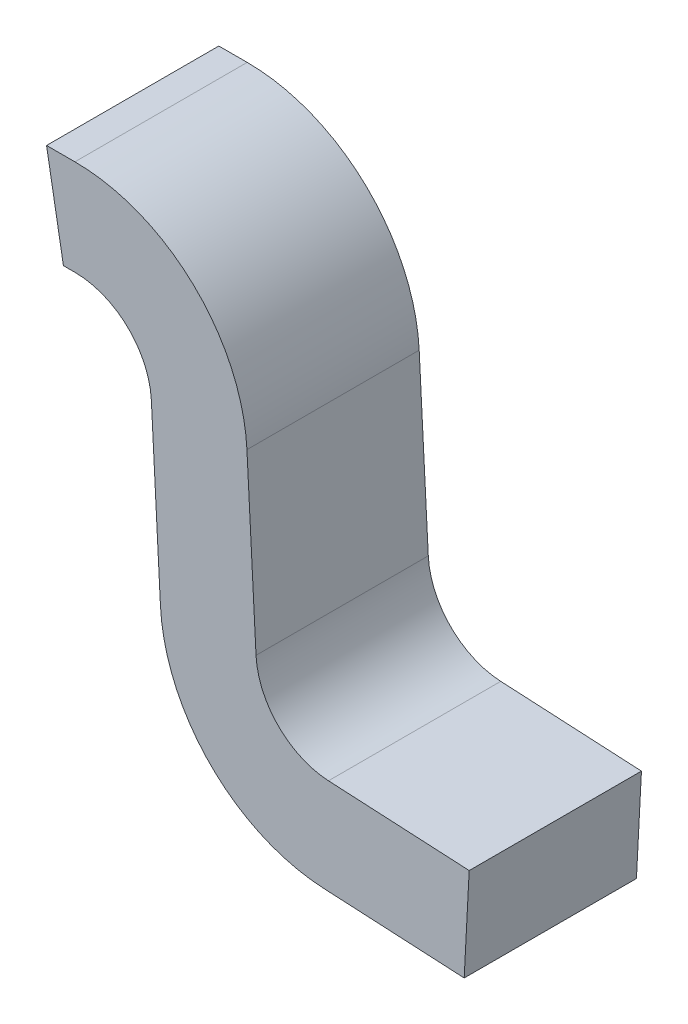
ISO-10303-21;
HEADER;
FILE_DESCRIPTION(('STEP AP214'),'2;1');
FILE_NAME('part.step','',(''),(''),'','','');
FILE_SCHEMA(('AUTOMOTIVE_DESIGN { 1 0 10303 214 1 1 1 1 }'));
ENDSEC;
DATA;
#1=APPLICATION_CONTEXT('core data for automotive mechanical design processes');
#2=APPLICATION_PROTOCOL_DEFINITION('international standard','automotive_design',2000,#1);
#3=PRODUCT_CONTEXT('',#1,'mechanical');
#4=PRODUCT('Part','Part','',(#3));
#5=PRODUCT_RELATED_PRODUCT_CATEGORY('part','',(#4));
#6=PRODUCT_DEFINITION_FORMATION('','',#4);
#7=PRODUCT_DEFINITION_CONTEXT('part definition',#1,'design');
#8=PRODUCT_DEFINITION('design','',#6,#7);
#9=PRODUCT_DEFINITION_SHAPE('','',#8);
#10=(LENGTH_UNIT() NAMED_UNIT(*) SI_UNIT(.MILLI.,.METRE.));
#11=(NAMED_UNIT(*) PLANE_ANGLE_UNIT() SI_UNIT($,.RADIAN.));
#12=(NAMED_UNIT(*) SI_UNIT($,.STERADIAN.) SOLID_ANGLE_UNIT());
#13=UNCERTAINTY_MEASURE_WITH_UNIT(LENGTH_MEASURE(1.E-05),#10,'distance_accuracy_value','');
#14=(GEOMETRIC_REPRESENTATION_CONTEXT(3) GLOBAL_UNCERTAINTY_ASSIGNED_CONTEXT((#13)) GLOBAL_UNIT_ASSIGNED_CONTEXT((#10,
#11,#12)) REPRESENTATION_CONTEXT('',''));
#15=CARTESIAN_POINT('',(0.,0.,0.));
#16=DIRECTION('',(0.,0.,1.));
#17=DIRECTION('',(1.,0.,0.));
#18=AXIS2_PLACEMENT_3D('',#15,#16,#17);
#19=CARTESIAN_POINT('',(0.,0.,-0.7625));
#20=DIRECTION('',(0.,0.,1.));
#21=DIRECTION('',(1.,0.,0.));
#22=AXIS2_PLACEMENT_3D('',#19,#20,#21);
#23=PLANE('',#22);
#24=DIRECTION('',(-0.0523359562429177,0.998629534754575,0.));
#25=VECTOR('',#24,1.);
#26=CARTESIAN_POINT('',(0.861573213012,-0.31493822705,-0.7625));
#27=LINE('',#26,#25);
#28=CARTESIAN_POINT('',(0.861573213012008,-0.31493822705016,-0.7625));
#29=VERTEX_POINT('',#28);
#30=CARTESIAN_POINT('',(0.849691645319655,-0.0882244098453541,-0.7625));
#31=VERTEX_POINT('',#30);
#32=EDGE_CURVE('E144',#29,#31,#27,.T.);
#33=ORIENTED_EDGE('',*,*,#32,.F.);
#34=CARTESIAN_POINT('',(0.961436166488,-0.309704631426,-0.7625));
#35=DIRECTION('',(0.,0.,1.));
#36=DIRECTION('',(1.,0.,0.));
#37=AXIS2_PLACEMENT_3D('',#34,#35,#36);
#38=CIRCLE('',#37,0.1);
#39=CARTESIAN_POINT('',(0.956202570863354,-0.40956758490123,-0.7625));
#40=VERTEX_POINT('',#39);
#41=EDGE_CURVE('E151',#29,#40,#38,.T.);
#42=ORIENTED_EDGE('',*,*,#41,.T.);
#43=DIRECTION('',(-0.998629534754575,0.0523359562429177,0.));
#44=VECTOR('',#43,1.);
#45=CARTESIAN_POINT('',(1.14,-0.4192,-0.7625));
#46=LINE('',#45,#44);
#47=CARTESIAN_POINT('',(1.14000000000012,-0.419200000000006,-0.7625));
#48=VERTEX_POINT('',#47);
#49=EDGE_CURVE('E148',#48,#40,#46,.T.);
#50=ORIENTED_EDGE('',*,*,#49,.F.);
#51=DIRECTION('',(0.0523359562429177,0.998629534754575,0.));
#52=VECTOR('',#51,1.);
#53=CARTESIAN_POINT('',(1.13345800547,-0.544028691844,-0.7625));
#54=LINE('',#53,#52);
#55=CARTESIAN_POINT('',(1.13345800547,-0.544028691843999,-0.7625));
#56=VERTEX_POINT('',#55);
#57=EDGE_CURVE('E155',#56,#48,#54,.T.);
#58=ORIENTED_EDGE('',*,*,#57,.F.);
#59=DIRECTION('',(0.998629534754575,-0.0523359562429177,0.));
#60=VECTOR('',#59,1.);
#61=CARTESIAN_POINT('',(0.949660576333,-0.534396276745,-0.7625));
#62=LINE('',#61,#60);
#63=CARTESIAN_POINT('',(0.949660576333192,-0.53439627674501,-0.7625));
#64=VERTEX_POINT('',#63);
#65=EDGE_CURVE('E160',#64,#56,#62,.T.);
#66=ORIENTED_EDGE('',*,*,#65,.F.);
#67=CARTESIAN_POINT('',(0.961436166488,-0.309704631426,-0.7625));
#68=DIRECTION('',(0.,0.,1.));
#69=DIRECTION('',(1.,0.,0.));
#70=AXIS2_PLACEMENT_3D('',#67,#68,#69);
#71=CIRCLE('',#70,0.225);
#72=CARTESIAN_POINT('',(0.736744521168336,-0.321480221580316,-0.7625));
#73=VERTEX_POINT('',#72);
#74=EDGE_CURVE('E117',#73,#64,#71,.T.);
#75=ORIENTED_EDGE('',*,*,#74,.F.);
#76=DIRECTION('',(0.0523359562429177,-0.998629534754575,0.));
#77=VECTOR('',#76,1.);
#78=CARTESIAN_POINT('',(0.724862953476,-0.09476640437571,-0.7625));
#79=LINE('',#78,#77);
#80=CARTESIAN_POINT('',(0.724862953475999,-0.0947664043756949,-0.7625));
#81=VERTEX_POINT('',#80);
#82=EDGE_CURVE('E114',#81,#73,#79,.T.);
#83=ORIENTED_EDGE('',*,*,#82,.F.);
#84=CARTESIAN_POINT('',(0.625,-0.1,-0.7625));
#85=DIRECTION('',(0.,0.,1.));
#86=DIRECTION('',(1.,0.,0.));
#87=AXIS2_PLACEMENT_3D('',#84,#85,#86);
#88=CIRCLE('',#87,0.1);
#89=CARTESIAN_POINT('',(0.625,0.,-0.7625));
#90=VERTEX_POINT('',#89);
#91=EDGE_CURVE('E20',#81,#90,#88,.T.);
#92=ORIENTED_EDGE('',*,*,#91,.T.);
#93=DIRECTION('',(1.,0.,0.));
#94=VECTOR('',#93,1.);
#95=CARTESIAN_POINT('',(0.61,0.,-0.7625));
#96=LINE('',#95,#94);
#97=CARTESIAN_POINT('',(0.609999999999862,0.,-0.7625));
#98=VERTEX_POINT('',#97);
#99=EDGE_CURVE('E132',#98,#90,#96,.T.);
#100=ORIENTED_EDGE('',*,*,#99,.F.);
#101=DIRECTION('',(0.173648177667033,-0.98480775301219,0.));
#102=VECTOR('',#101,1.);
#103=CARTESIAN_POINT('',(0.587959127411,0.125,-0.7625));
#104=LINE('',#103,#102);
#105=CARTESIAN_POINT('',(0.587959127411,0.125,-0.7625));
#106=VERTEX_POINT('',#105);
#107=EDGE_CURVE('E130',#106,#98,#104,.T.);
#108=ORIENTED_EDGE('',*,*,#107,.F.);
#109=DIRECTION('',(1.,0.,0.));
#110=VECTOR('',#109,1.);
#111=CARTESIAN_POINT('',(0.625,0.125,-0.7625));
#112=LINE('',#111,#110);
#113=CARTESIAN_POINT('',(0.625,0.125,-0.7625));
#114=VERTEX_POINT('',#113);
#115=EDGE_CURVE('E139',#114,#106,#112,.F.);
#116=ORIENTED_EDGE('',*,*,#115,.F.);
#117=CARTESIAN_POINT('',(0.625,-0.1,-0.7625));
#118=DIRECTION('',(0.,0.,1.));
#119=DIRECTION('',(1.,0.,0.));
#120=AXIS2_PLACEMENT_3D('',#117,#118,#119);
#121=CIRCLE('',#120,0.225);
#122=EDGE_CURVE('E180',#31,#114,#121,.T.);
#123=ORIENTED_EDGE('',*,*,#122,.F.);
#124=EDGE_LOOP('',(#33,#42,#50,#58,#66,#75,#83,#92,#100,#108,#116,#123));
#125=FACE_BOUND('',#124,.T.);
#126=ADVANCED_FACE('F17',(#125),#23,.F.);
#127=CARTESIAN_POINT('',(0.625,-0.1,-0.7625));
#128=DIRECTION('',(0.,0.,1.));
#129=DIRECTION('',(1.,0.,0.));
#130=AXIS2_PLACEMENT_3D('',#127,#128,#129);
#131=CYLINDRICAL_SURFACE('',#130,0.1);
#132=CARTESIAN_POINT('',(0.625,-0.1,-0.5375));
#133=DIRECTION('',(0.,0.,1.));
#134=DIRECTION('',(1.,0.,0.));
#135=AXIS2_PLACEMENT_3D('',#132,#133,#134);
#136=CIRCLE('',#135,0.1);
#137=CARTESIAN_POINT('',(0.625,0.,-0.5375));
#138=VERTEX_POINT('',#137);
#139=CARTESIAN_POINT('',(0.724862953476004,-0.0947664043757943,-0.5375));
#140=VERTEX_POINT('',#139);
#141=EDGE_CURVE('E178',#138,#140,#136,.F.);
#142=ORIENTED_EDGE('',*,*,#141,.F.);
#143=DIRECTION('',(0.,0.,-1.));
#144=VECTOR('',#143,1.);
#145=CARTESIAN_POINT('',(0.625,0.,-0.7625));
#146=LINE('',#145,#144);
#147=EDGE_CURVE('E110',#90,#138,#146,.F.);
#148=ORIENTED_EDGE('',*,*,#147,.F.);
#149=ORIENTED_EDGE('',*,*,#91,.F.);
#150=DIRECTION('',(0.,0.,1.));
#151=VECTOR('',#150,1.);
#152=CARTESIAN_POINT('',(0.724862953476,-0.09476640437571,-0.7625));
#153=LINE('',#152,#151);
#154=EDGE_CURVE('E107',#140,#81,#153,.F.);
#155=ORIENTED_EDGE('',*,*,#154,.F.);
#156=EDGE_LOOP('',(#142,#148,#149,#155));
#157=FACE_BOUND('',#156,.T.);
#158=ADVANCED_FACE('F105',(#157),#131,.F.);
#159=CARTESIAN_POINT('',(0.724862953476,-0.09476640437571,-0.7625));
#160=DIRECTION('',(-0.998629534754575,-0.0523359562429177,0.));
#161=DIRECTION('',(0.0523359562429177,-0.998629534754575,0.));
#162=AXIS2_PLACEMENT_3D('',#159,#160,#161);
#163=PLANE('',#162);
#164=ORIENTED_EDGE('',*,*,#154,.T.);
#165=ORIENTED_EDGE('',*,*,#82,.T.);
#166=DIRECTION('',(0.,0.,1.));
#167=VECTOR('',#166,1.);
#168=CARTESIAN_POINT('',(0.736744521168186,-0.32148022157999,-0.7625));
#169=LINE('',#168,#167);
#170=CARTESIAN_POINT('',(0.736744521168099,-0.321480221580105,-0.5375));
#171=VERTEX_POINT('',#170);
#172=EDGE_CURVE('E120',#171,#73,#169,.F.);
#173=ORIENTED_EDGE('',*,*,#172,.F.);
#174=DIRECTION('',(0.0523359562409312,-0.998629534754679,0.));
#175=VECTOR('',#174,1.);
#176=CARTESIAN_POINT('',(0.724862953476,-0.09476640437571,-0.5375));
#177=LINE('',#176,#175);
#178=EDGE_CURVE('E124',#140,#171,#177,.T.);
#179=ORIENTED_EDGE('',*,*,#178,.F.);
#180=EDGE_LOOP('',(#164,#165,#173,#179));
#181=FACE_BOUND('',#180,.T.);
#182=ADVANCED_FACE('F122',(#181),#163,.T.);
#183=CARTESIAN_POINT('',(0.961436166488,-0.309704631426,-0.7625));
#184=DIRECTION('',(0.,0.,1.));
#185=DIRECTION('',(1.,0.,0.));
#186=AXIS2_PLACEMENT_3D('',#183,#184,#185);
#187=CYLINDRICAL_SURFACE('',#186,0.225);
#188=ORIENTED_EDGE('',*,*,#172,.T.);
#189=ORIENTED_EDGE('',*,*,#74,.T.);
#190=DIRECTION('',(0.,0.,1.));
#191=VECTOR('',#190,1.);
#192=CARTESIAN_POINT('',(0.949660576333,-0.534396276745,-0.7625));
#193=LINE('',#192,#191);
#194=CARTESIAN_POINT('',(0.94966057633319,-0.53439627674501,-0.5375));
#195=VERTEX_POINT('',#194);
#196=EDGE_CURVE('E162',#195,#64,#193,.F.);
#197=ORIENTED_EDGE('',*,*,#196,.F.);
#198=CARTESIAN_POINT('',(0.961436166488,-0.309704631426,-0.5375));
#199=DIRECTION('',(0.,0.,1.));
#200=DIRECTION('',(1.,0.,0.));
#201=AXIS2_PLACEMENT_3D('',#198,#199,#200);
#202=CIRCLE('',#201,0.225);
#203=EDGE_CURVE('E174',#171,#195,#202,.T.);
#204=ORIENTED_EDGE('',*,*,#203,.F.);
#205=EDGE_LOOP('',(#188,#189,#197,#204));
#206=FACE_BOUND('',#205,.T.);
#207=ADVANCED_FACE('F186',(#206),#187,.T.);
#208=CARTESIAN_POINT('',(0.949660576333,-0.534396276745,-0.7625));
#209=DIRECTION('',(-0.0523359562429177,-0.998629534754575,0.));
#210=DIRECTION('',(0.998629534754575,-0.0523359562429177,0.));
#211=AXIS2_PLACEMENT_3D('',#208,#209,#210);
#212=PLANE('',#211);
#213=ORIENTED_EDGE('',*,*,#196,.T.);
#214=ORIENTED_EDGE('',*,*,#65,.T.);
#215=DIRECTION('',(0.,0.,1.));
#216=VECTOR('',#215,1.);
#217=CARTESIAN_POINT('',(1.13345800547,-0.544028691844,-0.7625));
#218=LINE('',#217,#216);
#219=CARTESIAN_POINT('',(1.13345800547,-0.544028691844,-0.5375));
#220=VERTEX_POINT('',#219);
#221=EDGE_CURVE('E157',#220,#56,#218,.F.);
#222=ORIENTED_EDGE('',*,*,#221,.F.);
#223=DIRECTION('',(0.998629534754574,-0.0523359562429318,0.));
#224=VECTOR('',#223,1.);
#225=CARTESIAN_POINT('',(0.949660576333,-0.534396276745,-0.5375));
#226=LINE('',#225,#224);
#227=EDGE_CURVE('E177',#195,#220,#226,.T.);
#228=ORIENTED_EDGE('',*,*,#227,.F.);
#229=EDGE_LOOP('',(#213,#214,#222,#228));
#230=FACE_BOUND('',#229,.T.);
#231=ADVANCED_FACE('F233',(#230),#212,.T.);
#232=CARTESIAN_POINT('',(1.13345800547,-0.544028691844,-0.7625));
#233=DIRECTION('',(0.998629534754575,-0.0523359562429177,0.));
#234=DIRECTION('',(0.0523359562429177,0.998629534754575,0.));
#235=AXIS2_PLACEMENT_3D('',#232,#233,#234);
#236=PLANE('',#235);
#237=ORIENTED_EDGE('',*,*,#221,.T.);
#238=ORIENTED_EDGE('',*,*,#57,.T.);
#239=DIRECTION('',(0.,0.,1.));
#240=VECTOR('',#239,1.);
#241=CARTESIAN_POINT('',(1.14,-0.4192,-0.7625));
#242=LINE('',#241,#240);
#243=CARTESIAN_POINT('',(1.14,-0.4192,-0.5375));
#244=VERTEX_POINT('',#243);
#245=EDGE_CURVE('E152',#244,#48,#242,.F.);
#246=ORIENTED_EDGE('',*,*,#245,.F.);
#247=DIRECTION('',(0.0523359562401418,0.998629534754721,0.));
#248=VECTOR('',#247,1.);
#249=CARTESIAN_POINT('',(1.13345800547,-0.544028691844,-0.5375));
#250=LINE('',#249,#248);
#251=EDGE_CURVE('E219',#220,#244,#250,.T.);
#252=ORIENTED_EDGE('',*,*,#251,.F.);
#253=EDGE_LOOP('',(#237,#238,#246,#252));
#254=FACE_BOUND('',#253,.T.);
#255=ADVANCED_FACE('F229',(#254),#236,.T.);
#256=CARTESIAN_POINT('',(1.14,-0.4192,-0.7625));
#257=DIRECTION('',(0.0523359562429177,0.998629534754575,0.));
#258=DIRECTION('',(-0.998629534754575,0.0523359562429177,0.));
#259=AXIS2_PLACEMENT_3D('',#256,#257,#258);
#260=PLANE('',#259);
#261=ORIENTED_EDGE('',*,*,#245,.T.);
#262=ORIENTED_EDGE('',*,*,#49,.T.);
#263=DIRECTION('',(0.,0.,1.));
#264=VECTOR('',#263,1.);
#265=CARTESIAN_POINT('',(0.956202570862978,-0.409567584901419,-0.7625));
#266=LINE('',#265,#264);
#267=CARTESIAN_POINT('',(0.956202570863353,-0.409567584901229,-0.5375));
#268=VERTEX_POINT('',#267);
#269=EDGE_CURVE('E182',#40,#268,#266,.T.);
#270=ORIENTED_EDGE('',*,*,#269,.T.);
#271=DIRECTION('',(-0.998629534754574,0.0523359562429318,0.));
#272=VECTOR('',#271,1.);
#273=CARTESIAN_POINT('',(1.14,-0.4192,-0.5375));
#274=LINE('',#273,#272);
#275=EDGE_CURVE('E173',#244,#268,#274,.T.);
#276=ORIENTED_EDGE('',*,*,#275,.F.);
#277=EDGE_LOOP('',(#261,#262,#270,#276));
#278=FACE_BOUND('',#277,.T.);
#279=ADVANCED_FACE('F237',(#278),#260,.T.);
#280=CARTESIAN_POINT('',(0.961436166488,-0.309704631426,-0.7625));
#281=DIRECTION('',(0.,0.,1.));
#282=DIRECTION('',(1.,0.,0.));
#283=AXIS2_PLACEMENT_3D('',#280,#281,#282);
#284=CYLINDRICAL_SURFACE('',#283,0.1);
#285=CARTESIAN_POINT('',(0.961436166488,-0.309704631426,-0.5375));
#286=DIRECTION('',(0.,0.,1.));
#287=DIRECTION('',(1.,0.,0.));
#288=AXIS2_PLACEMENT_3D('',#285,#286,#287);
#289=CIRCLE('',#288,0.1);
#290=CARTESIAN_POINT('',(0.861573213012003,-0.314938227050056,-0.5375));
#291=VERTEX_POINT('',#290);
#292=EDGE_CURVE('E170',#268,#291,#289,.F.);
#293=ORIENTED_EDGE('',*,*,#292,.F.);
#294=ORIENTED_EDGE('',*,*,#269,.F.);
#295=ORIENTED_EDGE('',*,*,#41,.F.);
#296=DIRECTION('',(0.,0.,1.));
#297=VECTOR('',#296,1.);
#298=CARTESIAN_POINT('',(0.861573213012,-0.31493822705,-0.7625));
#299=LINE('',#298,#297);
#300=EDGE_CURVE('E147',#291,#29,#299,.F.);
#301=ORIENTED_EDGE('',*,*,#300,.F.);
#302=EDGE_LOOP('',(#293,#294,#295,#301));
#303=FACE_BOUND('',#302,.T.);
#304=ADVANCED_FACE('F312',(#303),#284,.F.);
#305=CARTESIAN_POINT('',(0.861573213012,-0.31493822705,-0.7625));
#306=DIRECTION('',(0.998629534754575,0.0523359562429177,0.));
#307=DIRECTION('',(-0.0523359562429177,0.998629534754575,0.));
#308=AXIS2_PLACEMENT_3D('',#305,#306,#307);
#309=PLANE('',#308);
#310=ORIENTED_EDGE('',*,*,#300,.T.);
#311=ORIENTED_EDGE('',*,*,#32,.T.);
#312=DIRECTION('',(0.,0.,1.));
#313=VECTOR('',#312,1.);
#314=CARTESIAN_POINT('',(0.84969164531978,-0.0882244098453515,-0.7625));
#315=LINE('',#314,#313);
#316=CARTESIAN_POINT('',(0.849691645319902,-0.0882244098455748,-0.5375));
#317=VERTEX_POINT('',#316);
#318=EDGE_CURVE('E146',#317,#31,#315,.F.);
#319=ORIENTED_EDGE('',*,*,#318,.F.);
#320=DIRECTION('',(-0.052335956240846,0.998629534754684,0.));
#321=VECTOR('',#320,1.);
#322=CARTESIAN_POINT('',(0.861573213012,-0.31493822705,-0.5375));
#323=LINE('',#322,#321);
#324=EDGE_CURVE('E169',#291,#317,#323,.T.);
#325=ORIENTED_EDGE('',*,*,#324,.F.);
#326=EDGE_LOOP('',(#310,#311,#319,#325));
#327=FACE_BOUND('',#326,.T.);
#328=ADVANCED_FACE('F302',(#327),#309,.T.);
#329=CARTESIAN_POINT('',(0.625,-0.1,-0.7625));
#330=DIRECTION('',(0.,0.,1.));
#331=DIRECTION('',(1.,0.,0.));
#332=AXIS2_PLACEMENT_3D('',#329,#330,#331);
#333=CYLINDRICAL_SURFACE('',#332,0.225);
#334=ORIENTED_EDGE('',*,*,#318,.T.);
#335=ORIENTED_EDGE('',*,*,#122,.T.);
#336=DIRECTION('',(0.,0.,1.));
#337=VECTOR('',#336,1.);
#338=CARTESIAN_POINT('',(0.625,0.125,-0.7625));
#339=LINE('',#338,#337);
#340=CARTESIAN_POINT('',(0.625,0.125,-0.5375));
#341=VERTEX_POINT('',#340);
#342=EDGE_CURVE('E141',#341,#114,#339,.F.);
#343=ORIENTED_EDGE('',*,*,#342,.F.);
#344=CARTESIAN_POINT('',(0.625,-0.1,-0.5375));
#345=DIRECTION('',(0.,0.,1.));
#346=DIRECTION('',(1.,0.,0.));
#347=AXIS2_PLACEMENT_3D('',#344,#345,#346);
#348=CIRCLE('',#347,0.225);
#349=EDGE_CURVE('E165',#317,#341,#348,.T.);
#350=ORIENTED_EDGE('',*,*,#349,.F.);
#351=EDGE_LOOP('',(#334,#335,#343,#350));
#352=FACE_BOUND('',#351,.T.);
#353=ADVANCED_FACE('F268',(#352),#333,.T.);
#354=CARTESIAN_POINT('',(0.625,0.125,-0.7625));
#355=DIRECTION('',(0.,1.,0.));
#356=DIRECTION('',(0.,0.,1.));
#357=AXIS2_PLACEMENT_3D('',#354,#355,#356);
#358=PLANE('',#357);
#359=DIRECTION('',(0.,0.,1.));
#360=VECTOR('',#359,1.);
#361=CARTESIAN_POINT('',(0.587959127411,0.125,-0.7625));
#362=LINE('',#361,#360);
#363=CARTESIAN_POINT('',(0.587959127411,0.125,-0.5375));
#364=VERTEX_POINT('',#363);
#365=EDGE_CURVE('E133',#364,#106,#362,.F.);
#366=ORIENTED_EDGE('',*,*,#365,.F.);
#367=DIRECTION('',(1.,0.,0.));
#368=VECTOR('',#367,1.);
#369=CARTESIAN_POINT('',(0.,0.125,-0.5375));
#370=LINE('',#369,#368);
#371=EDGE_CURVE('E168',#341,#364,#370,.F.);
#372=ORIENTED_EDGE('',*,*,#371,.F.);
#373=ORIENTED_EDGE('',*,*,#342,.T.);
#374=ORIENTED_EDGE('',*,*,#115,.T.);
#375=EDGE_LOOP('',(#366,#372,#373,#374));
#376=FACE_BOUND('',#375,.T.);
#377=ADVANCED_FACE('F254',(#376),#358,.T.);
#378=CARTESIAN_POINT('',(0.587959127411,0.125,-0.7625));
#379=DIRECTION('',(-0.98480775301219,-0.173648177667033,0.));
#380=DIRECTION('',(0.173648177667033,-0.98480775301219,0.));
#381=AXIS2_PLACEMENT_3D('',#378,#379,#380);
#382=PLANE('',#381);
#383=ORIENTED_EDGE('',*,*,#107,.T.);
#384=DIRECTION('',(0.,0.,-1.));
#385=VECTOR('',#384,1.);
#386=CARTESIAN_POINT('',(0.61,0.,-0.7625));
#387=LINE('',#386,#385);
#388=CARTESIAN_POINT('',(0.61,0.,-0.5375));
#389=VERTEX_POINT('',#388);
#390=EDGE_CURVE('E35',#389,#98,#387,.T.);
#391=ORIENTED_EDGE('',*,*,#390,.F.);
#392=DIRECTION('',(0.173648177670306,-0.984807753011613,0.));
#393=VECTOR('',#392,1.);
#394=CARTESIAN_POINT('',(0.587959127411,0.125,-0.5375));
#395=LINE('',#394,#393);
#396=EDGE_CURVE('E26',#364,#389,#395,.T.);
#397=ORIENTED_EDGE('',*,*,#396,.F.);
#398=ORIENTED_EDGE('',*,*,#365,.T.);
#399=EDGE_LOOP('',(#383,#391,#397,#398));
#400=FACE_BOUND('',#399,.T.);
#401=ADVANCED_FACE('F257',(#400),#382,.T.);
#402=CARTESIAN_POINT('',(0.61,0.,-0.7625));
#403=DIRECTION('',(0.,-1.,0.));
#404=DIRECTION('',(0.,0.,-1.));
#405=AXIS2_PLACEMENT_3D('',#402,#403,#404);
#406=PLANE('',#405);
#407=DIRECTION('',(1.,0.,0.));
#408=VECTOR('',#407,1.);
#409=CARTESIAN_POINT('',(0.,0.,-0.5375));
#410=LINE('',#409,#408);
#411=EDGE_CURVE('E11',#389,#138,#410,.T.);
#412=ORIENTED_EDGE('',*,*,#411,.F.);
#413=ORIENTED_EDGE('',*,*,#390,.T.);
#414=ORIENTED_EDGE('',*,*,#99,.T.);
#415=ORIENTED_EDGE('',*,*,#147,.T.);
#416=EDGE_LOOP('',(#412,#413,#414,#415));
#417=FACE_BOUND('',#416,.T.);
#418=ADVANCED_FACE('F259',(#417),#406,.T.);
#419=CARTESIAN_POINT('',(0.,0.,-0.5375));
#420=DIRECTION('',(0.,0.,1.));
#421=DIRECTION('',(1.,0.,0.));
#422=AXIS2_PLACEMENT_3D('',#419,#420,#421);
#423=PLANE('',#422);
#424=ORIENTED_EDGE('',*,*,#396,.T.);
#425=ORIENTED_EDGE('',*,*,#411,.T.);
#426=ORIENTED_EDGE('',*,*,#141,.T.);
#427=ORIENTED_EDGE('',*,*,#178,.T.);
#428=ORIENTED_EDGE('',*,*,#203,.T.);
#429=ORIENTED_EDGE('',*,*,#227,.T.);
#430=ORIENTED_EDGE('',*,*,#251,.T.);
#431=ORIENTED_EDGE('',*,*,#275,.T.);
#432=ORIENTED_EDGE('',*,*,#292,.T.);
#433=ORIENTED_EDGE('',*,*,#324,.T.);
#434=ORIENTED_EDGE('',*,*,#349,.T.);
#435=ORIENTED_EDGE('',*,*,#371,.T.);
#436=EDGE_LOOP('',(#424,#425,#426,#427,#428,#429,#430,#431,#432,#433,#434,#435));
#437=FACE_BOUND('',#436,.T.);
#438=ADVANCED_FACE('F191',(#437),#423,.T.);
#439=CLOSED_SHELL('',(#126,#158,#182,#207,#231,#255,#279,#304,#328,#353,#377,#401,#418,#438));
#440=MANIFOLD_SOLID_BREP('B1',#439);
#441=ADVANCED_BREP_SHAPE_REPRESENTATION('',(#18,#440),#14);
#442=SHAPE_DEFINITION_REPRESENTATION(#9,#441);
ENDSEC;
END-ISO-10303-21;
